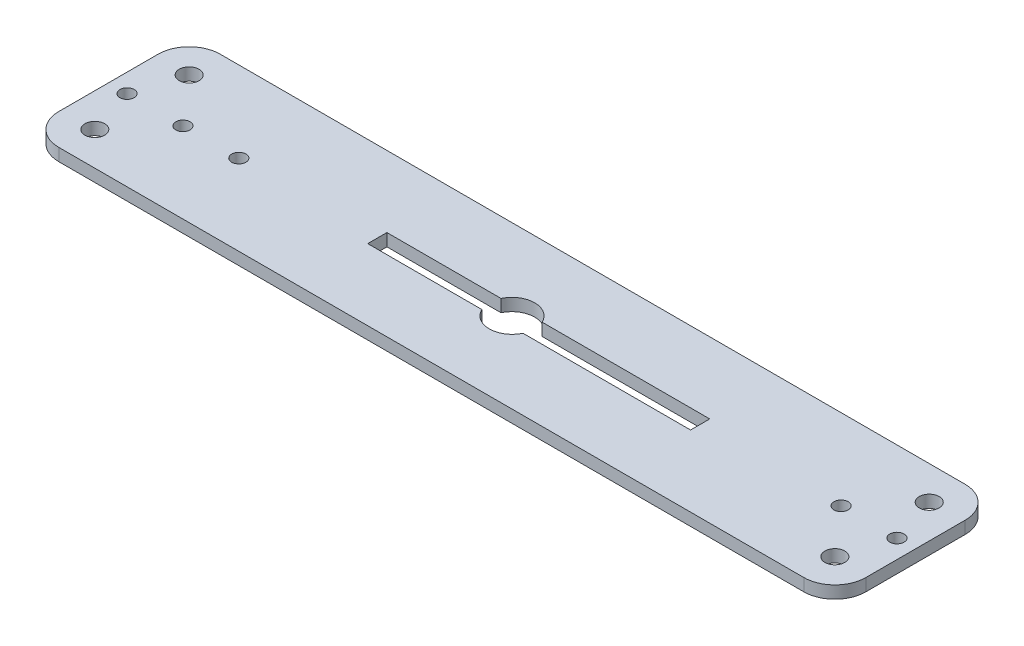
ISO-10303-21;
HEADER;
FILE_DESCRIPTION(('STEP AP214'),'2;1');
FILE_NAME('part.step','',(''),(''),'','','');
FILE_SCHEMA(('AUTOMOTIVE_DESIGN { 1 0 10303 214 1 1 1 1 }'));
ENDSEC;
DATA;
#1=APPLICATION_CONTEXT('core data for automotive mechanical design processes');
#2=APPLICATION_PROTOCOL_DEFINITION('international standard','automotive_design',2000,#1);
#3=PRODUCT_CONTEXT('',#1,'mechanical');
#4=PRODUCT('Part','Part','',(#3));
#5=PRODUCT_RELATED_PRODUCT_CATEGORY('part','',(#4));
#6=PRODUCT_DEFINITION_FORMATION('','',#4);
#7=PRODUCT_DEFINITION_CONTEXT('part definition',#1,'design');
#8=PRODUCT_DEFINITION('design','',#6,#7);
#9=PRODUCT_DEFINITION_SHAPE('','',#8);
#10=(LENGTH_UNIT() NAMED_UNIT(*) SI_UNIT(.MILLI.,.METRE.));
#11=(NAMED_UNIT(*) PLANE_ANGLE_UNIT() SI_UNIT($,.RADIAN.));
#12=(NAMED_UNIT(*) SI_UNIT($,.STERADIAN.) SOLID_ANGLE_UNIT());
#13=UNCERTAINTY_MEASURE_WITH_UNIT(LENGTH_MEASURE(1.E-05),#10,'distance_accuracy_value','');
#14=(GEOMETRIC_REPRESENTATION_CONTEXT(3) GLOBAL_UNCERTAINTY_ASSIGNED_CONTEXT((#13)) GLOBAL_UNIT_ASSIGNED_CONTEXT((#10,
#11,#12)) REPRESENTATION_CONTEXT('',''));
#15=CARTESIAN_POINT('',(0.,0.,0.));
#16=DIRECTION('',(0.,0.,1.));
#17=DIRECTION('',(1.,0.,0.));
#18=AXIS2_PLACEMENT_3D('',#15,#16,#17);
#19=CARTESIAN_POINT('',(60.,2.,-8.));
#20=DIRECTION('',(0.,1.,0.));
#21=DIRECTION('',(0.,0.,1.));
#22=AXIS2_PLACEMENT_3D('',#19,#20,#21);
#23=PLANE('',#22);
#24=CARTESIAN_POINT('',(-53.,2.,8.32369151180203E-13));
#25=DIRECTION('',(0.,1.,0.));
#26=DIRECTION('',(0.,0.,1.));
#27=AXIS2_PLACEMENT_3D('',#24,#25,#26);
#28=CIRCLE('',#27,1.15);
#29=CARTESIAN_POINT('',(-53.,2.,1.15000000000083));
#30=VERTEX_POINT('',#29);
#31=EDGE_CURVE('E408',#30,#30,#28,.T.);
#32=ORIENTED_EDGE('',*,*,#31,.F.);
#33=EDGE_LOOP('',(#32));
#34=FACE_BOUND('',#33,.T.);
#35=CARTESIAN_POINT('',(-59.6,2.,-7.59999999999916));
#36=DIRECTION('',(0.,1.,0.));
#37=DIRECTION('',(0.,0.,1.));
#38=AXIS2_PLACEMENT_3D('',#35,#36,#37);
#39=CIRCLE('',#38,1.6);
#40=CARTESIAN_POINT('',(-59.6,2.,-5.99999999999917));
#41=VERTEX_POINT('',#40);
#42=EDGE_CURVE('E420',#41,#41,#39,.T.);
#43=ORIENTED_EDGE('',*,*,#42,.F.);
#44=EDGE_LOOP('',(#43));
#45=FACE_BOUND('',#44,.T.);
#46=CARTESIAN_POINT('',(53.,2.,0.));
#47=DIRECTION('',(0.,1.,0.));
#48=DIRECTION('',(0.,0.,1.));
#49=AXIS2_PLACEMENT_3D('',#46,#47,#48);
#50=CIRCLE('',#49,1.15);
#51=CARTESIAN_POINT('',(53.,2.,1.14999999999999));
#52=VERTEX_POINT('',#51);
#53=EDGE_CURVE('E432',#52,#52,#50,.T.);
#54=ORIENTED_EDGE('',*,*,#53,.F.);
#55=EDGE_LOOP('',(#54));
#56=FACE_BOUND('',#55,.T.);
#57=CARTESIAN_POINT('',(59.6,2.,7.6));
#58=DIRECTION('',(0.,1.,0.));
#59=DIRECTION('',(0.,0.,1.));
#60=AXIS2_PLACEMENT_3D('',#57,#58,#59);
#61=CIRCLE('',#60,1.6);
#62=CARTESIAN_POINT('',(59.6,2.,9.19999999999999));
#63=VERTEX_POINT('',#62);
#64=EDGE_CURVE('E444',#63,#63,#61,.T.);
#65=ORIENTED_EDGE('',*,*,#64,.F.);
#66=EDGE_LOOP('',(#65));
#67=FACE_BOUND('',#66,.T.);
#68=DIRECTION('',(-1.,0.,0.));
#69=VECTOR('',#68,1.);
#70=CARTESIAN_POINT('',(3.30714399453822,2.,-1.54444119324422));
#71=LINE('',#70,#69);
#72=CARTESIAN_POINT('',(30.3071439945382,2.,-1.54444119324422));
#73=VERTEX_POINT('',#72);
#74=CARTESIAN_POINT('',(3.30714399453822,2.,-1.54444119324422));
#75=VERTEX_POINT('',#74);
#76=EDGE_CURVE('E153',#73,#75,#71,.T.);
#77=ORIENTED_EDGE('',*,*,#76,.F.);
#78=DIRECTION('',(0.,0.,-1.));
#79=VECTOR('',#78,1.);
#80=CARTESIAN_POINT('',(30.3071439945382,2.,-1.54444119324422));
#81=LINE('',#80,#79);
#82=CARTESIAN_POINT('',(30.3071439945382,2.,1.54444119324422));
#83=VERTEX_POINT('',#82);
#84=EDGE_CURVE('E145',#83,#73,#81,.T.);
#85=ORIENTED_EDGE('',*,*,#84,.F.);
#86=DIRECTION('',(1.,0.,0.));
#87=VECTOR('',#86,1.);
#88=CARTESIAN_POINT('',(3.30714399453821,2.,1.54444119324422));
#89=LINE('',#88,#87);
#90=CARTESIAN_POINT('',(3.30714399453821,2.,1.54444119324423));
#91=VERTEX_POINT('',#90);
#92=EDGE_CURVE('E180',#91,#83,#89,.T.);
#93=ORIENTED_EDGE('',*,*,#92,.F.);
#94=CARTESIAN_POINT('',(0.,2.,0.));
#95=DIRECTION('',(0.,1.,0.));
#96=DIRECTION('',(0.,0.,1.));
#97=AXIS2_PLACEMENT_3D('',#94,#95,#96);
#98=CIRCLE('',#97,3.65);
#99=CARTESIAN_POINT('',(-3.30714399453827,2.,1.54444119324422));
#100=VERTEX_POINT('',#99);
#101=EDGE_CURVE('E178',#100,#91,#98,.T.);
#102=ORIENTED_EDGE('',*,*,#101,.F.);
#103=DIRECTION('',(1.,0.,0.));
#104=VECTOR('',#103,1.);
#105=CARTESIAN_POINT('',(-21.6928560054618,2.,1.54444119324422));
#106=LINE('',#105,#104);
#107=CARTESIAN_POINT('',(-21.6928560054618,2.,1.54444119324422));
#108=VERTEX_POINT('',#107);
#109=EDGE_CURVE('E176',#108,#100,#106,.T.);
#110=ORIENTED_EDGE('',*,*,#109,.F.);
#111=DIRECTION('',(0.,0.,1.));
#112=VECTOR('',#111,1.);
#113=CARTESIAN_POINT('',(-21.6928560054618,2.,-1.54444119324422));
#114=LINE('',#113,#112);
#115=CARTESIAN_POINT('',(-21.6928560054618,2.,-1.54444119324422));
#116=VERTEX_POINT('',#115);
#117=EDGE_CURVE('E174',#116,#108,#114,.T.);
#118=ORIENTED_EDGE('',*,*,#117,.F.);
#119=DIRECTION('',(-1.,0.,0.));
#120=VECTOR('',#119,1.);
#121=CARTESIAN_POINT('',(-21.6928560054618,2.,-1.54444119324422));
#122=LINE('',#121,#120);
#123=CARTESIAN_POINT('',(-3.30714399453827,2.,-1.54444119324422));
#124=VERTEX_POINT('',#123);
#125=EDGE_CURVE('E169',#124,#116,#122,.T.);
#126=ORIENTED_EDGE('',*,*,#125,.F.);
#127=CARTESIAN_POINT('',(0.,2.,0.));
#128=DIRECTION('',(0.,1.,0.));
#129=DIRECTION('',(0.,0.,1.));
#130=AXIS2_PLACEMENT_3D('',#127,#128,#129);
#131=CIRCLE('',#130,3.65);
#132=EDGE_CURVE('E167',#75,#124,#131,.T.);
#133=ORIENTED_EDGE('',*,*,#132,.F.);
#134=EDGE_LOOP('',(#77,#85,#93,#102,#110,#118,#126,#133));
#135=FACE_BOUND('',#134,.T.);
#136=CARTESIAN_POINT('',(60.,2.,-8.));
#137=DIRECTION('',(0.,1.,0.));
#138=DIRECTION('',(0.,0.,1.));
#139=AXIS2_PLACEMENT_3D('',#136,#137,#138);
#140=CIRCLE('',#139,5.);
#141=CARTESIAN_POINT('',(65.,2.,-7.99999999999997));
#142=VERTEX_POINT('',#141);
#143=CARTESIAN_POINT('',(59.9999999999999,2.,-13.));
#144=VERTEX_POINT('',#143);
#145=EDGE_CURVE('E213',#142,#144,#140,.T.);
#146=ORIENTED_EDGE('',*,*,#145,.T.);
#147=DIRECTION('',(-1.,0.,0.));
#148=VECTOR('',#147,1.);
#149=CARTESIAN_POINT('',(-60.,2.,-13.));
#150=LINE('',#149,#148);
#151=CARTESIAN_POINT('',(-60.,2.,-13.));
#152=VERTEX_POINT('',#151);
#153=EDGE_CURVE('E216',#144,#152,#150,.T.);
#154=ORIENTED_EDGE('',*,*,#153,.T.);
#155=CARTESIAN_POINT('',(-60.,2.,-8.));
#156=DIRECTION('',(0.,1.,0.));
#157=DIRECTION('',(0.,0.,-1.));
#158=AXIS2_PLACEMENT_3D('',#155,#156,#157);
#159=CIRCLE('',#158,5.);
#160=CARTESIAN_POINT('',(-65.,2.,-7.99999999999997));
#161=VERTEX_POINT('',#160);
#162=EDGE_CURVE('E219',#152,#161,#159,.T.);
#163=ORIENTED_EDGE('',*,*,#162,.T.);
#164=DIRECTION('',(0.,0.,1.));
#165=VECTOR('',#164,1.);
#166=CARTESIAN_POINT('',(-65.,2.,7.99999999999996));
#167=LINE('',#166,#165);
#168=CARTESIAN_POINT('',(-65.,2.,7.99999999999996));
#169=VERTEX_POINT('',#168);
#170=EDGE_CURVE('E221',#161,#169,#167,.T.);
#171=ORIENTED_EDGE('',*,*,#170,.T.);
#172=CARTESIAN_POINT('',(-60.,2.,8.));
#173=DIRECTION('',(0.,1.,0.));
#174=DIRECTION('',(0.,0.,-1.));
#175=AXIS2_PLACEMENT_3D('',#172,#173,#174);
#176=CIRCLE('',#175,5.);
#177=CARTESIAN_POINT('',(-60.,2.,13.));
#178=VERTEX_POINT('',#177);
#179=EDGE_CURVE('E223',#169,#178,#176,.T.);
#180=ORIENTED_EDGE('',*,*,#179,.T.);
#181=DIRECTION('',(1.,0.,0.));
#182=VECTOR('',#181,1.);
#183=CARTESIAN_POINT('',(-60.,2.,13.));
#184=LINE('',#183,#182);
#185=CARTESIAN_POINT('',(59.9999999999999,2.,13.));
#186=VERTEX_POINT('',#185);
#187=EDGE_CURVE('E225',#178,#186,#184,.T.);
#188=ORIENTED_EDGE('',*,*,#187,.T.);
#189=CARTESIAN_POINT('',(60.,2.,8.));
#190=DIRECTION('',(0.,1.,0.));
#191=DIRECTION('',(0.,0.,-1.));
#192=AXIS2_PLACEMENT_3D('',#189,#190,#191);
#193=CIRCLE('',#192,5.);
#194=CARTESIAN_POINT('',(65.,2.,7.99999999999996));
#195=VERTEX_POINT('',#194);
#196=EDGE_CURVE('E227',#186,#195,#193,.T.);
#197=ORIENTED_EDGE('',*,*,#196,.T.);
#198=DIRECTION('',(0.,0.,-1.));
#199=VECTOR('',#198,1.);
#200=CARTESIAN_POINT('',(65.,2.,7.99999999999996));
#201=LINE('',#200,#199);
#202=EDGE_CURVE('E229',#195,#142,#201,.T.);
#203=ORIENTED_EDGE('',*,*,#202,.T.);
#204=EDGE_LOOP('',(#146,#154,#163,#171,#180,#188,#197,#203));
#205=FACE_BOUND('',#204,.T.);
#206=CARTESIAN_POINT('',(59.6,2.,-7.6));
#207=DIRECTION('',(0.,1.,0.));
#208=DIRECTION('',(0.,0.,1.));
#209=AXIS2_PLACEMENT_3D('',#206,#207,#208);
#210=CIRCLE('',#209,1.6);
#211=CARTESIAN_POINT('',(59.6,2.,-6.));
#212=VERTEX_POINT('',#211);
#213=EDGE_CURVE('E183',#212,#212,#210,.T.);
#214=ORIENTED_EDGE('',*,*,#213,.F.);
#215=EDGE_LOOP('',(#214));
#216=FACE_BOUND('',#215,.T.);
#217=CARTESIAN_POINT('',(62.,2.,0.));
#218=DIRECTION('',(0.,1.,0.));
#219=DIRECTION('',(0.,0.,1.));
#220=AXIS2_PLACEMENT_3D('',#217,#218,#219);
#221=CIRCLE('',#220,1.15000000000002);
#222=CARTESIAN_POINT('',(62.,2.,1.15000000000002));
#223=VERTEX_POINT('',#222);
#224=EDGE_CURVE('E438',#223,#223,#221,.T.);
#225=ORIENTED_EDGE('',*,*,#224,.F.);
#226=EDGE_LOOP('',(#225));
#227=FACE_BOUND('',#226,.T.);
#228=CARTESIAN_POINT('',(-62.,2.,8.32369151180203E-13));
#229=DIRECTION('',(0.,1.,0.));
#230=DIRECTION('',(0.,0.,1.));
#231=AXIS2_PLACEMENT_3D('',#228,#229,#230);
#232=CIRCLE('',#231,1.15);
#233=CARTESIAN_POINT('',(-62.,2.,1.15000000000083));
#234=VERTEX_POINT('',#233);
#235=EDGE_CURVE('E426',#234,#234,#232,.T.);
#236=ORIENTED_EDGE('',*,*,#235,.F.);
#237=EDGE_LOOP('',(#236));
#238=FACE_BOUND('',#237,.T.);
#239=CARTESIAN_POINT('',(-59.6,2.,7.60000000000083));
#240=DIRECTION('',(0.,1.,0.));
#241=DIRECTION('',(0.,0.,1.));
#242=AXIS2_PLACEMENT_3D('',#239,#240,#241);
#243=CIRCLE('',#242,1.6);
#244=CARTESIAN_POINT('',(-59.6,2.,9.20000000000083));
#245=VERTEX_POINT('',#244);
#246=EDGE_CURVE('E414',#245,#245,#243,.T.);
#247=ORIENTED_EDGE('',*,*,#246,.F.);
#248=EDGE_LOOP('',(#247));
#249=FACE_BOUND('',#248,.T.);
#250=CARTESIAN_POINT('',(-44.,2.,8.32369067656005E-13));
#251=DIRECTION('',(0.,1.,0.));
#252=DIRECTION('',(0.,0.,1.));
#253=AXIS2_PLACEMENT_3D('',#250,#251,#252);
#254=CIRCLE('',#253,1.15);
#255=CARTESIAN_POINT('',(-44.,2.,1.15000000000083));
#256=VERTEX_POINT('',#255);
#257=EDGE_CURVE('E399',#256,#256,#254,.T.);
#258=ORIENTED_EDGE('',*,*,#257,.F.);
#259=EDGE_LOOP('',(#258));
#260=FACE_BOUND('',#259,.T.);
#261=ADVANCED_FACE('F32',(#34,#45,#56,#67,#135,#205,#216,#227,#238,#249,#260),#23,.T.);
#262=CARTESIAN_POINT('',(60.,0.,-8.));
#263=DIRECTION('',(0.,1.,0.));
#264=DIRECTION('',(0.,0.,1.));
#265=AXIS2_PLACEMENT_3D('',#262,#263,#264);
#266=PLANE('',#265);
#267=CARTESIAN_POINT('',(-53.,0.,8.32369151180203E-13));
#268=DIRECTION('',(0.,1.,0.));
#269=DIRECTION('',(0.,0.,1.));
#270=AXIS2_PLACEMENT_3D('',#267,#268,#269);
#271=CIRCLE('',#270,1.15);
#272=CARTESIAN_POINT('',(-53.,0.,1.15000000000083));
#273=VERTEX_POINT('',#272);
#274=EDGE_CURVE('E405',#273,#273,#271,.T.);
#275=ORIENTED_EDGE('',*,*,#274,.T.);
#276=EDGE_LOOP('',(#275));
#277=FACE_BOUND('',#276,.T.);
#278=CARTESIAN_POINT('',(-59.6,0.,-7.59999999999916));
#279=DIRECTION('',(0.,1.,0.));
#280=DIRECTION('',(0.,0.,1.));
#281=AXIS2_PLACEMENT_3D('',#278,#279,#280);
#282=CIRCLE('',#281,1.6);
#283=CARTESIAN_POINT('',(-59.6,0.,-5.99999999999917));
#284=VERTEX_POINT('',#283);
#285=EDGE_CURVE('E417',#284,#284,#282,.T.);
#286=ORIENTED_EDGE('',*,*,#285,.T.);
#287=EDGE_LOOP('',(#286));
#288=FACE_BOUND('',#287,.T.);
#289=CARTESIAN_POINT('',(53.,0.,0.));
#290=DIRECTION('',(0.,1.,0.));
#291=DIRECTION('',(0.,0.,1.));
#292=AXIS2_PLACEMENT_3D('',#289,#290,#291);
#293=CIRCLE('',#292,1.15);
#294=CARTESIAN_POINT('',(53.,0.,1.14999999999999));
#295=VERTEX_POINT('',#294);
#296=EDGE_CURVE('E429',#295,#295,#293,.T.);
#297=ORIENTED_EDGE('',*,*,#296,.T.);
#298=EDGE_LOOP('',(#297));
#299=FACE_BOUND('',#298,.T.);
#300=CARTESIAN_POINT('',(59.6,0.,7.6));
#301=DIRECTION('',(0.,1.,0.));
#302=DIRECTION('',(0.,0.,1.));
#303=AXIS2_PLACEMENT_3D('',#300,#301,#302);
#304=CIRCLE('',#303,1.6);
#305=CARTESIAN_POINT('',(59.6,0.,9.19999999999999));
#306=VERTEX_POINT('',#305);
#307=EDGE_CURVE('E441',#306,#306,#304,.T.);
#308=ORIENTED_EDGE('',*,*,#307,.T.);
#309=EDGE_LOOP('',(#308));
#310=FACE_BOUND('',#309,.T.);
#311=DIRECTION('',(0.,0.,-1.));
#312=VECTOR('',#311,1.);
#313=CARTESIAN_POINT('',(30.3071439945382,0.,-1.54444119324422));
#314=LINE('',#313,#312);
#315=CARTESIAN_POINT('',(30.3071439945382,0.,1.54444119324423));
#316=VERTEX_POINT('',#315);
#317=CARTESIAN_POINT('',(30.3071439945382,0.,-1.54444119324422));
#318=VERTEX_POINT('',#317);
#319=EDGE_CURVE('E55',#316,#318,#314,.T.);
#320=ORIENTED_EDGE('',*,*,#319,.T.);
#321=DIRECTION('',(-1.,0.,0.));
#322=VECTOR('',#321,1.);
#323=CARTESIAN_POINT('',(3.30714399453822,0.,-1.54444119324422));
#324=LINE('',#323,#322);
#325=CARTESIAN_POINT('',(3.30714399453822,0.,-1.54444119324422));
#326=VERTEX_POINT('',#325);
#327=EDGE_CURVE('E160',#318,#326,#324,.T.);
#328=ORIENTED_EDGE('',*,*,#327,.T.);
#329=CARTESIAN_POINT('',(0.,0.,0.));
#330=DIRECTION('',(0.,1.,0.));
#331=DIRECTION('',(0.,0.,1.));
#332=AXIS2_PLACEMENT_3D('',#329,#330,#331);
#333=CIRCLE('',#332,3.65);
#334=CARTESIAN_POINT('',(-3.30714399453827,0.,-1.54444119324422));
#335=VERTEX_POINT('',#334);
#336=EDGE_CURVE('E185',#326,#335,#333,.T.);
#337=ORIENTED_EDGE('',*,*,#336,.T.);
#338=DIRECTION('',(-1.,0.,0.));
#339=VECTOR('',#338,1.);
#340=CARTESIAN_POINT('',(-21.6928560054618,0.,-1.54444119324422));
#341=LINE('',#340,#339);
#342=CARTESIAN_POINT('',(-21.6928560054618,0.,-1.54444119324422));
#343=VERTEX_POINT('',#342);
#344=EDGE_CURVE('E188',#335,#343,#341,.T.);
#345=ORIENTED_EDGE('',*,*,#344,.T.);
#346=DIRECTION('',(0.,0.,1.));
#347=VECTOR('',#346,1.);
#348=CARTESIAN_POINT('',(-21.6928560054618,0.,-1.54444119324422));
#349=LINE('',#348,#347);
#350=CARTESIAN_POINT('',(-21.6928560054618,0.,1.54444119324422));
#351=VERTEX_POINT('',#350);
#352=EDGE_CURVE('E191',#343,#351,#349,.T.);
#353=ORIENTED_EDGE('',*,*,#352,.T.);
#354=DIRECTION('',(1.,0.,0.));
#355=VECTOR('',#354,1.);
#356=CARTESIAN_POINT('',(-21.6928560054618,0.,1.54444119324422));
#357=LINE('',#356,#355);
#358=CARTESIAN_POINT('',(-3.30714399453827,0.,1.54444119324422));
#359=VERTEX_POINT('',#358);
#360=EDGE_CURVE('E194',#351,#359,#357,.T.);
#361=ORIENTED_EDGE('',*,*,#360,.T.);
#362=CARTESIAN_POINT('',(0.,0.,0.));
#363=DIRECTION('',(0.,1.,0.));
#364=DIRECTION('',(0.,0.,1.));
#365=AXIS2_PLACEMENT_3D('',#362,#363,#364);
#366=CIRCLE('',#365,3.65);
#367=CARTESIAN_POINT('',(3.30714399453821,0.,1.54444119324422));
#368=VERTEX_POINT('',#367);
#369=EDGE_CURVE('E197',#359,#368,#366,.T.);
#370=ORIENTED_EDGE('',*,*,#369,.T.);
#371=DIRECTION('',(1.,0.,0.));
#372=VECTOR('',#371,1.);
#373=CARTESIAN_POINT('',(3.30714399453821,0.,1.54444119324422));
#374=LINE('',#373,#372);
#375=EDGE_CURVE('E154',#368,#316,#374,.T.);
#376=ORIENTED_EDGE('',*,*,#375,.T.);
#377=EDGE_LOOP('',(#320,#328,#337,#345,#353,#361,#370,#376));
#378=FACE_BOUND('',#377,.T.);
#379=CARTESIAN_POINT('',(60.,0.,-8.));
#380=DIRECTION('',(0.,1.,0.));
#381=DIRECTION('',(0.,0.,1.));
#382=AXIS2_PLACEMENT_3D('',#379,#380,#381);
#383=CIRCLE('',#382,5.);
#384=CARTESIAN_POINT('',(65.,0.,-7.99999999999997));
#385=VERTEX_POINT('',#384);
#386=CARTESIAN_POINT('',(59.9999999999999,0.,-13.));
#387=VERTEX_POINT('',#386);
#388=EDGE_CURVE('E161',#385,#387,#383,.T.);
#389=ORIENTED_EDGE('',*,*,#388,.F.);
#390=DIRECTION('',(0.,0.,-1.));
#391=VECTOR('',#390,1.);
#392=CARTESIAN_POINT('',(65.,0.,7.99999999999996));
#393=LINE('',#392,#391);
#394=CARTESIAN_POINT('',(65.,0.,7.99999999999996));
#395=VERTEX_POINT('',#394);
#396=EDGE_CURVE('E217',#395,#385,#393,.T.);
#397=ORIENTED_EDGE('',*,*,#396,.F.);
#398=CARTESIAN_POINT('',(60.,0.,8.));
#399=DIRECTION('',(0.,1.,0.));
#400=DIRECTION('',(0.,0.,-1.));
#401=AXIS2_PLACEMENT_3D('',#398,#399,#400);
#402=CIRCLE('',#401,5.);
#403=CARTESIAN_POINT('',(59.9999999999999,0.,13.));
#404=VERTEX_POINT('',#403);
#405=EDGE_CURVE('E244',#404,#395,#402,.T.);
#406=ORIENTED_EDGE('',*,*,#405,.F.);
#407=DIRECTION('',(1.,0.,0.));
#408=VECTOR('',#407,1.);
#409=CARTESIAN_POINT('',(-60.,0.,13.));
#410=LINE('',#409,#408);
#411=CARTESIAN_POINT('',(-60.,0.,13.));
#412=VERTEX_POINT('',#411);
#413=EDGE_CURVE('E242',#412,#404,#410,.T.);
#414=ORIENTED_EDGE('',*,*,#413,.F.);
#415=CARTESIAN_POINT('',(-60.,0.,8.));
#416=DIRECTION('',(0.,1.,0.));
#417=DIRECTION('',(0.,0.,-1.));
#418=AXIS2_PLACEMENT_3D('',#415,#416,#417);
#419=CIRCLE('',#418,5.);
#420=CARTESIAN_POINT('',(-65.,0.,7.99999999999996));
#421=VERTEX_POINT('',#420);
#422=EDGE_CURVE('E240',#421,#412,#419,.T.);
#423=ORIENTED_EDGE('',*,*,#422,.F.);
#424=DIRECTION('',(0.,0.,1.));
#425=VECTOR('',#424,1.);
#426=CARTESIAN_POINT('',(-65.,0.,7.99999999999996));
#427=LINE('',#426,#425);
#428=CARTESIAN_POINT('',(-65.,0.,-7.99999999999997));
#429=VERTEX_POINT('',#428);
#430=EDGE_CURVE('E238',#429,#421,#427,.T.);
#431=ORIENTED_EDGE('',*,*,#430,.F.);
#432=CARTESIAN_POINT('',(-60.,0.,-8.));
#433=DIRECTION('',(0.,1.,0.));
#434=DIRECTION('',(0.,0.,-1.));
#435=AXIS2_PLACEMENT_3D('',#432,#433,#434);
#436=CIRCLE('',#435,5.);
#437=CARTESIAN_POINT('',(-60.,0.,-13.));
#438=VERTEX_POINT('',#437);
#439=EDGE_CURVE('E236',#438,#429,#436,.T.);
#440=ORIENTED_EDGE('',*,*,#439,.F.);
#441=DIRECTION('',(-1.,0.,0.));
#442=VECTOR('',#441,1.);
#443=CARTESIAN_POINT('',(-60.,0.,-13.));
#444=LINE('',#443,#442);
#445=EDGE_CURVE('E234',#387,#438,#444,.T.);
#446=ORIENTED_EDGE('',*,*,#445,.F.);
#447=EDGE_LOOP('',(#389,#397,#406,#414,#423,#431,#440,#446));
#448=FACE_BOUND('',#447,.T.);
#449=CARTESIAN_POINT('',(59.6,0.,-7.6));
#450=DIRECTION('',(0.,1.,0.));
#451=DIRECTION('',(0.,0.,1.));
#452=AXIS2_PLACEMENT_3D('',#449,#450,#451);
#453=CIRCLE('',#452,1.6);
#454=CARTESIAN_POINT('',(59.6,0.,-6.));
#455=VERTEX_POINT('',#454);
#456=EDGE_CURVE('E447',#455,#455,#453,.T.);
#457=ORIENTED_EDGE('',*,*,#456,.T.);
#458=EDGE_LOOP('',(#457));
#459=FACE_BOUND('',#458,.T.);
#460=CARTESIAN_POINT('',(62.,0.,0.));
#461=DIRECTION('',(0.,1.,0.));
#462=DIRECTION('',(0.,0.,1.));
#463=AXIS2_PLACEMENT_3D('',#460,#461,#462);
#464=CIRCLE('',#463,1.15000000000002);
#465=CARTESIAN_POINT('',(62.,0.,1.15000000000002));
#466=VERTEX_POINT('',#465);
#467=EDGE_CURVE('E435',#466,#466,#464,.T.);
#468=ORIENTED_EDGE('',*,*,#467,.T.);
#469=EDGE_LOOP('',(#468));
#470=FACE_BOUND('',#469,.T.);
#471=CARTESIAN_POINT('',(-62.,0.,8.32369151180203E-13));
#472=DIRECTION('',(0.,1.,0.));
#473=DIRECTION('',(0.,0.,1.));
#474=AXIS2_PLACEMENT_3D('',#471,#472,#473);
#475=CIRCLE('',#474,1.15);
#476=CARTESIAN_POINT('',(-62.,0.,1.15000000000083));
#477=VERTEX_POINT('',#476);
#478=EDGE_CURVE('E423',#477,#477,#475,.T.);
#479=ORIENTED_EDGE('',*,*,#478,.T.);
#480=EDGE_LOOP('',(#479));
#481=FACE_BOUND('',#480,.T.);
#482=CARTESIAN_POINT('',(-59.6,0.,7.60000000000083));
#483=DIRECTION('',(0.,1.,0.));
#484=DIRECTION('',(0.,0.,1.));
#485=AXIS2_PLACEMENT_3D('',#482,#483,#484);
#486=CIRCLE('',#485,1.6);
#487=CARTESIAN_POINT('',(-59.6,0.,9.20000000000083));
#488=VERTEX_POINT('',#487);
#489=EDGE_CURVE('E411',#488,#488,#486,.T.);
#490=ORIENTED_EDGE('',*,*,#489,.T.);
#491=EDGE_LOOP('',(#490));
#492=FACE_BOUND('',#491,.T.);
#493=CARTESIAN_POINT('',(-44.,0.,8.32369067656005E-13));
#494=DIRECTION('',(0.,1.,0.));
#495=DIRECTION('',(0.,0.,1.));
#496=AXIS2_PLACEMENT_3D('',#493,#494,#495);
#497=CIRCLE('',#496,1.15);
#498=CARTESIAN_POINT('',(-44.,0.,1.15000000000083));
#499=VERTEX_POINT('',#498);
#500=EDGE_CURVE('E402',#499,#499,#497,.T.);
#501=ORIENTED_EDGE('',*,*,#500,.T.);
#502=EDGE_LOOP('',(#501));
#503=FACE_BOUND('',#502,.T.);
#504=ADVANCED_FACE('F274',(#277,#288,#299,#310,#378,#448,#459,#470,#481,#492,#503),#266,.F.);
#505=CARTESIAN_POINT('',(60.,2.,-8.));
#506=DIRECTION('',(0.,-1.,0.));
#507=DIRECTION('',(0.,0.,-1.));
#508=AXIS2_PLACEMENT_3D('',#505,#506,#507);
#509=CYLINDRICAL_SURFACE('',#508,5.);
#510=ORIENTED_EDGE('',*,*,#388,.T.);
#511=DIRECTION('',(0.,-1.,0.));
#512=VECTOR('',#511,1.);
#513=CARTESIAN_POINT('',(59.9999999999999,2.,-13.));
#514=LINE('',#513,#512);
#515=EDGE_CURVE('E11',#144,#387,#514,.T.);
#516=ORIENTED_EDGE('',*,*,#515,.F.);
#517=ORIENTED_EDGE('',*,*,#145,.F.);
#518=DIRECTION('',(0.,-1.,0.));
#519=VECTOR('',#518,1.);
#520=CARTESIAN_POINT('',(65.,2.,-7.99999999999997));
#521=LINE('',#520,#519);
#522=EDGE_CURVE('E231',#142,#385,#521,.T.);
#523=ORIENTED_EDGE('',*,*,#522,.T.);
#524=EDGE_LOOP('',(#510,#516,#517,#523));
#525=FACE_BOUND('',#524,.T.);
#526=ADVANCED_FACE('F34',(#525),#509,.T.);
#527=CARTESIAN_POINT('',(-60.,2.,-13.));
#528=DIRECTION('',(0.,0.,1.));
#529=DIRECTION('',(1.,0.,0.));
#530=AXIS2_PLACEMENT_3D('',#527,#528,#529);
#531=PLANE('',#530);
#532=ORIENTED_EDGE('',*,*,#445,.T.);
#533=DIRECTION('',(0.,-1.,0.));
#534=VECTOR('',#533,1.);
#535=CARTESIAN_POINT('',(-60.,2.,-13.));
#536=LINE('',#535,#534);
#537=EDGE_CURVE('E40',#152,#438,#536,.T.);
#538=ORIENTED_EDGE('',*,*,#537,.F.);
#539=ORIENTED_EDGE('',*,*,#153,.F.);
#540=ORIENTED_EDGE('',*,*,#515,.T.);
#541=EDGE_LOOP('',(#532,#538,#539,#540));
#542=FACE_BOUND('',#541,.T.);
#543=ADVANCED_FACE('F291',(#542),#531,.F.);
#544=CARTESIAN_POINT('',(-60.,2.,-8.));
#545=DIRECTION('',(0.,-1.,0.));
#546=DIRECTION('',(0.,0.,-1.));
#547=AXIS2_PLACEMENT_3D('',#544,#545,#546);
#548=CYLINDRICAL_SURFACE('',#547,5.);
#549=ORIENTED_EDGE('',*,*,#439,.T.);
#550=DIRECTION('',(0.,-1.,0.));
#551=VECTOR('',#550,1.);
#552=CARTESIAN_POINT('',(-65.,2.,-7.99999999999997));
#553=LINE('',#552,#551);
#554=EDGE_CURVE('E261',#161,#429,#553,.T.);
#555=ORIENTED_EDGE('',*,*,#554,.F.);
#556=ORIENTED_EDGE('',*,*,#162,.F.);
#557=ORIENTED_EDGE('',*,*,#537,.T.);
#558=EDGE_LOOP('',(#549,#555,#556,#557));
#559=FACE_BOUND('',#558,.T.);
#560=ADVANCED_FACE('F268',(#559),#548,.T.);
#561=CARTESIAN_POINT('',(-65.,2.,7.99999999999996));
#562=DIRECTION('',(1.,0.,0.));
#563=DIRECTION('',(0.,0.,-1.));
#564=AXIS2_PLACEMENT_3D('',#561,#562,#563);
#565=PLANE('',#564);
#566=ORIENTED_EDGE('',*,*,#430,.T.);
#567=DIRECTION('',(0.,-1.,0.));
#568=VECTOR('',#567,1.);
#569=CARTESIAN_POINT('',(-65.,2.,7.99999999999996));
#570=LINE('',#569,#568);
#571=EDGE_CURVE('E258',#169,#421,#570,.T.);
#572=ORIENTED_EDGE('',*,*,#571,.F.);
#573=ORIENTED_EDGE('',*,*,#170,.F.);
#574=ORIENTED_EDGE('',*,*,#554,.T.);
#575=EDGE_LOOP('',(#566,#572,#573,#574));
#576=FACE_BOUND('',#575,.T.);
#577=ADVANCED_FACE('F280',(#576),#565,.F.);
#578=CARTESIAN_POINT('',(-60.,2.,8.));
#579=DIRECTION('',(0.,-1.,0.));
#580=DIRECTION('',(0.,0.,-1.));
#581=AXIS2_PLACEMENT_3D('',#578,#579,#580);
#582=CYLINDRICAL_SURFACE('',#581,5.);
#583=ORIENTED_EDGE('',*,*,#422,.T.);
#584=DIRECTION('',(0.,-1.,0.));
#585=VECTOR('',#584,1.);
#586=CARTESIAN_POINT('',(-60.,2.,13.));
#587=LINE('',#586,#585);
#588=EDGE_CURVE('E255',#178,#412,#587,.T.);
#589=ORIENTED_EDGE('',*,*,#588,.F.);
#590=ORIENTED_EDGE('',*,*,#179,.F.);
#591=ORIENTED_EDGE('',*,*,#571,.T.);
#592=EDGE_LOOP('',(#583,#589,#590,#591));
#593=FACE_BOUND('',#592,.T.);
#594=ADVANCED_FACE('F284',(#593),#582,.T.);
#595=CARTESIAN_POINT('',(-60.,2.,13.));
#596=DIRECTION('',(0.,0.,-1.));
#597=DIRECTION('',(-1.,0.,0.));
#598=AXIS2_PLACEMENT_3D('',#595,#596,#597);
#599=PLANE('',#598);
#600=ORIENTED_EDGE('',*,*,#413,.T.);
#601=DIRECTION('',(0.,-1.,0.));
#602=VECTOR('',#601,1.);
#603=CARTESIAN_POINT('',(59.9999999999999,2.,13.));
#604=LINE('',#603,#602);
#605=EDGE_CURVE('E252',#186,#404,#604,.T.);
#606=ORIENTED_EDGE('',*,*,#605,.F.);
#607=ORIENTED_EDGE('',*,*,#187,.F.);
#608=ORIENTED_EDGE('',*,*,#588,.T.);
#609=EDGE_LOOP('',(#600,#606,#607,#608));
#610=FACE_BOUND('',#609,.T.);
#611=ADVANCED_FACE('F304',(#610),#599,.F.);
#612=CARTESIAN_POINT('',(60.,2.,8.));
#613=DIRECTION('',(0.,-1.,0.));
#614=DIRECTION('',(0.,0.,-1.));
#615=AXIS2_PLACEMENT_3D('',#612,#613,#614);
#616=CYLINDRICAL_SURFACE('',#615,5.);
#617=ORIENTED_EDGE('',*,*,#405,.T.);
#618=DIRECTION('',(0.,-1.,0.));
#619=VECTOR('',#618,1.);
#620=CARTESIAN_POINT('',(65.,2.,7.99999999999996));
#621=LINE('',#620,#619);
#622=EDGE_CURVE('E249',#195,#395,#621,.T.);
#623=ORIENTED_EDGE('',*,*,#622,.F.);
#624=ORIENTED_EDGE('',*,*,#196,.F.);
#625=ORIENTED_EDGE('',*,*,#605,.T.);
#626=EDGE_LOOP('',(#617,#623,#624,#625));
#627=FACE_BOUND('',#626,.T.);
#628=ADVANCED_FACE('F302',(#627),#616,.T.);
#629=CARTESIAN_POINT('',(65.,2.,7.99999999999996));
#630=DIRECTION('',(-1.,0.,0.));
#631=DIRECTION('',(0.,0.,1.));
#632=AXIS2_PLACEMENT_3D('',#629,#630,#631);
#633=PLANE('',#632);
#634=ORIENTED_EDGE('',*,*,#396,.T.);
#635=ORIENTED_EDGE('',*,*,#522,.F.);
#636=ORIENTED_EDGE('',*,*,#202,.F.);
#637=ORIENTED_EDGE('',*,*,#622,.T.);
#638=EDGE_LOOP('',(#634,#635,#636,#637));
#639=FACE_BOUND('',#638,.T.);
#640=ADVANCED_FACE('F297',(#639),#633,.F.);
#641=CARTESIAN_POINT('',(30.3071439945382,2.,-1.54444119324422));
#642=DIRECTION('',(-1.,0.,0.));
#643=DIRECTION('',(0.,0.,1.));
#644=AXIS2_PLACEMENT_3D('',#641,#642,#643);
#645=PLANE('',#644);
#646=ORIENTED_EDGE('',*,*,#319,.F.);
#647=DIRECTION('',(0.,-1.,0.));
#648=VECTOR('',#647,1.);
#649=CARTESIAN_POINT('',(30.3071439945382,2.,1.54444119324422));
#650=LINE('',#649,#648);
#651=EDGE_CURVE('E149',#83,#316,#650,.T.);
#652=ORIENTED_EDGE('',*,*,#651,.F.);
#653=ORIENTED_EDGE('',*,*,#84,.T.);
#654=DIRECTION('',(0.,-1.,0.));
#655=VECTOR('',#654,1.);
#656=CARTESIAN_POINT('',(30.3071439945382,2.,-1.54444119324422));
#657=LINE('',#656,#655);
#658=EDGE_CURVE('E148',#73,#318,#657,.T.);
#659=ORIENTED_EDGE('',*,*,#658,.T.);
#660=EDGE_LOOP('',(#646,#652,#653,#659));
#661=FACE_BOUND('',#660,.T.);
#662=ADVANCED_FACE('F147',(#661),#645,.T.);
#663=CARTESIAN_POINT('',(3.30714399453822,2.,-1.54444119324422));
#664=DIRECTION('',(0.,0.,1.));
#665=DIRECTION('',(1.,0.,0.));
#666=AXIS2_PLACEMENT_3D('',#663,#664,#665);
#667=PLANE('',#666);
#668=ORIENTED_EDGE('',*,*,#327,.F.);
#669=ORIENTED_EDGE('',*,*,#658,.F.);
#670=ORIENTED_EDGE('',*,*,#76,.T.);
#671=DIRECTION('',(0.,-1.,0.));
#672=VECTOR('',#671,1.);
#673=CARTESIAN_POINT('',(3.30714399453822,2.,-1.54444119324422));
#674=LINE('',#673,#672);
#675=EDGE_CURVE('E162',#75,#326,#674,.T.);
#676=ORIENTED_EDGE('',*,*,#675,.T.);
#677=EDGE_LOOP('',(#668,#669,#670,#676));
#678=FACE_BOUND('',#677,.T.);
#679=ADVANCED_FACE('F157',(#678),#667,.T.);
#680=CARTESIAN_POINT('',(0.,2.,0.));
#681=DIRECTION('',(0.,-1.,0.));
#682=DIRECTION('',(0.,0.,-1.));
#683=AXIS2_PLACEMENT_3D('',#680,#681,#682);
#684=CYLINDRICAL_SURFACE('',#683,3.65);
#685=ORIENTED_EDGE('',*,*,#336,.F.);
#686=ORIENTED_EDGE('',*,*,#675,.F.);
#687=ORIENTED_EDGE('',*,*,#132,.T.);
#688=DIRECTION('',(0.,-1.,0.));
#689=VECTOR('',#688,1.);
#690=CARTESIAN_POINT('',(-3.30714399453827,2.,-1.54444119324422));
#691=LINE('',#690,#689);
#692=EDGE_CURVE('E210',#124,#335,#691,.T.);
#693=ORIENTED_EDGE('',*,*,#692,.T.);
#694=EDGE_LOOP('',(#685,#686,#687,#693));
#695=FACE_BOUND('',#694,.T.);
#696=ADVANCED_FACE('F333',(#695),#684,.F.);
#697=CARTESIAN_POINT('',(-21.6928560054618,2.,-1.54444119324422));
#698=DIRECTION('',(0.,0.,1.));
#699=DIRECTION('',(1.,0.,0.));
#700=AXIS2_PLACEMENT_3D('',#697,#698,#699);
#701=PLANE('',#700);
#702=ORIENTED_EDGE('',*,*,#344,.F.);
#703=ORIENTED_EDGE('',*,*,#692,.F.);
#704=ORIENTED_EDGE('',*,*,#125,.T.);
#705=DIRECTION('',(0.,-1.,0.));
#706=VECTOR('',#705,1.);
#707=CARTESIAN_POINT('',(-21.6928560054618,2.,-1.54444119324422));
#708=LINE('',#707,#706);
#709=EDGE_CURVE('E208',#116,#343,#708,.T.);
#710=ORIENTED_EDGE('',*,*,#709,.T.);
#711=EDGE_LOOP('',(#702,#703,#704,#710));
#712=FACE_BOUND('',#711,.T.);
#713=ADVANCED_FACE('F337',(#712),#701,.T.);
#714=CARTESIAN_POINT('',(-21.6928560054618,2.,-1.54444119324422));
#715=DIRECTION('',(1.,0.,0.));
#716=DIRECTION('',(0.,0.,-1.));
#717=AXIS2_PLACEMENT_3D('',#714,#715,#716);
#718=PLANE('',#717);
#719=ORIENTED_EDGE('',*,*,#352,.F.);
#720=ORIENTED_EDGE('',*,*,#709,.F.);
#721=ORIENTED_EDGE('',*,*,#117,.T.);
#722=DIRECTION('',(0.,-1.,0.));
#723=VECTOR('',#722,1.);
#724=CARTESIAN_POINT('',(-21.6928560054618,2.,1.54444119324422));
#725=LINE('',#724,#723);
#726=EDGE_CURVE('E206',#108,#351,#725,.T.);
#727=ORIENTED_EDGE('',*,*,#726,.T.);
#728=EDGE_LOOP('',(#719,#720,#721,#727));
#729=FACE_BOUND('',#728,.T.);
#730=ADVANCED_FACE('F343',(#729),#718,.T.);
#731=CARTESIAN_POINT('',(-21.6928560054618,2.,1.54444119324422));
#732=DIRECTION('',(0.,0.,-1.));
#733=DIRECTION('',(-1.,0.,0.));
#734=AXIS2_PLACEMENT_3D('',#731,#732,#733);
#735=PLANE('',#734);
#736=ORIENTED_EDGE('',*,*,#360,.F.);
#737=ORIENTED_EDGE('',*,*,#726,.F.);
#738=ORIENTED_EDGE('',*,*,#109,.T.);
#739=DIRECTION('',(0.,-1.,0.));
#740=VECTOR('',#739,1.);
#741=CARTESIAN_POINT('',(-3.30714399453827,2.,1.54444119324422));
#742=LINE('',#741,#740);
#743=EDGE_CURVE('E204',#100,#359,#742,.T.);
#744=ORIENTED_EDGE('',*,*,#743,.T.);
#745=EDGE_LOOP('',(#736,#737,#738,#744));
#746=FACE_BOUND('',#745,.T.);
#747=ADVANCED_FACE('F347',(#746),#735,.T.);
#748=CARTESIAN_POINT('',(0.,2.,0.));
#749=DIRECTION('',(0.,-1.,0.));
#750=DIRECTION('',(0.,0.,-1.));
#751=AXIS2_PLACEMENT_3D('',#748,#749,#750);
#752=CYLINDRICAL_SURFACE('',#751,3.65);
#753=ORIENTED_EDGE('',*,*,#369,.F.);
#754=ORIENTED_EDGE('',*,*,#743,.F.);
#755=ORIENTED_EDGE('',*,*,#101,.T.);
#756=DIRECTION('',(0.,-1.,0.));
#757=VECTOR('',#756,1.);
#758=CARTESIAN_POINT('',(3.30714399453821,2.,1.54444119324422));
#759=LINE('',#758,#757);
#760=EDGE_CURVE('E47',#91,#368,#759,.T.);
#761=ORIENTED_EDGE('',*,*,#760,.T.);
#762=EDGE_LOOP('',(#753,#754,#755,#761));
#763=FACE_BOUND('',#762,.T.);
#764=ADVANCED_FACE('F351',(#763),#752,.F.);
#765=CARTESIAN_POINT('',(3.30714399453821,2.,1.54444119324422));
#766=DIRECTION('',(0.,0.,-1.));
#767=DIRECTION('',(-1.,0.,0.));
#768=AXIS2_PLACEMENT_3D('',#765,#766,#767);
#769=PLANE('',#768);
#770=ORIENTED_EDGE('',*,*,#375,.F.);
#771=ORIENTED_EDGE('',*,*,#760,.F.);
#772=ORIENTED_EDGE('',*,*,#92,.T.);
#773=ORIENTED_EDGE('',*,*,#651,.T.);
#774=EDGE_LOOP('',(#770,#771,#772,#773));
#775=FACE_BOUND('',#774,.T.);
#776=ADVANCED_FACE('F355',(#775),#769,.T.);
#777=CARTESIAN_POINT('',(59.6,2.,-7.6));
#778=DIRECTION('',(0.,-1.,0.));
#779=DIRECTION('',(0.,0.,-1.));
#780=AXIS2_PLACEMENT_3D('',#777,#778,#779);
#781=CYLINDRICAL_SURFACE('',#780,1.6);
#782=ORIENTED_EDGE('',*,*,#213,.T.);
#783=EDGE_LOOP('',(#782));
#784=FACE_BOUND('',#783,.T.);
#785=ORIENTED_EDGE('',*,*,#456,.F.);
#786=EDGE_LOOP('',(#785));
#787=FACE_BOUND('',#786,.T.);
#788=ADVANCED_FACE('F359',(#784,#787),#781,.F.);
#789=CARTESIAN_POINT('',(59.6,2.,7.6));
#790=DIRECTION('',(0.,-1.,0.));
#791=DIRECTION('',(0.,0.,-1.));
#792=AXIS2_PLACEMENT_3D('',#789,#790,#791);
#793=CYLINDRICAL_SURFACE('',#792,1.6);
#794=ORIENTED_EDGE('',*,*,#64,.T.);
#795=EDGE_LOOP('',(#794));
#796=FACE_BOUND('',#795,.T.);
#797=ORIENTED_EDGE('',*,*,#307,.F.);
#798=EDGE_LOOP('',(#797));
#799=FACE_BOUND('',#798,.T.);
#800=ADVANCED_FACE('F362',(#796,#799),#793,.F.);
#801=CARTESIAN_POINT('',(62.,2.,0.));
#802=DIRECTION('',(0.,-1.,0.));
#803=DIRECTION('',(0.,0.,-1.));
#804=AXIS2_PLACEMENT_3D('',#801,#802,#803);
#805=CYLINDRICAL_SURFACE('',#804,1.15000000000002);
#806=ORIENTED_EDGE('',*,*,#224,.T.);
#807=EDGE_LOOP('',(#806));
#808=FACE_BOUND('',#807,.T.);
#809=ORIENTED_EDGE('',*,*,#467,.F.);
#810=EDGE_LOOP('',(#809));
#811=FACE_BOUND('',#810,.T.);
#812=ADVANCED_FACE('F366',(#808,#811),#805,.F.);
#813=CARTESIAN_POINT('',(53.,2.,0.));
#814=DIRECTION('',(0.,-1.,0.));
#815=DIRECTION('',(0.,0.,-1.));
#816=AXIS2_PLACEMENT_3D('',#813,#814,#815);
#817=CYLINDRICAL_SURFACE('',#816,1.15);
#818=ORIENTED_EDGE('',*,*,#53,.T.);
#819=EDGE_LOOP('',(#818));
#820=FACE_BOUND('',#819,.T.);
#821=ORIENTED_EDGE('',*,*,#296,.F.);
#822=EDGE_LOOP('',(#821));
#823=FACE_BOUND('',#822,.T.);
#824=ADVANCED_FACE('F370',(#820,#823),#817,.F.);
#825=CARTESIAN_POINT('',(-62.,2.,8.32369151180203E-13));
#826=DIRECTION('',(0.,-1.,0.));
#827=DIRECTION('',(0.,0.,-1.));
#828=AXIS2_PLACEMENT_3D('',#825,#826,#827);
#829=CYLINDRICAL_SURFACE('',#828,1.15);
#830=ORIENTED_EDGE('',*,*,#235,.T.);
#831=EDGE_LOOP('',(#830));
#832=FACE_BOUND('',#831,.T.);
#833=ORIENTED_EDGE('',*,*,#478,.F.);
#834=EDGE_LOOP('',(#833));
#835=FACE_BOUND('',#834,.T.);
#836=ADVANCED_FACE('F374',(#832,#835),#829,.F.);
#837=CARTESIAN_POINT('',(-59.6,2.,-7.59999999999916));
#838=DIRECTION('',(0.,-1.,0.));
#839=DIRECTION('',(0.,0.,-1.));
#840=AXIS2_PLACEMENT_3D('',#837,#838,#839);
#841=CYLINDRICAL_SURFACE('',#840,1.6);
#842=ORIENTED_EDGE('',*,*,#42,.T.);
#843=EDGE_LOOP('',(#842));
#844=FACE_BOUND('',#843,.T.);
#845=ORIENTED_EDGE('',*,*,#285,.F.);
#846=EDGE_LOOP('',(#845));
#847=FACE_BOUND('',#846,.T.);
#848=ADVANCED_FACE('F378',(#844,#847),#841,.F.);
#849=CARTESIAN_POINT('',(-59.6,2.,7.60000000000083));
#850=DIRECTION('',(0.,-1.,0.));
#851=DIRECTION('',(0.,0.,-1.));
#852=AXIS2_PLACEMENT_3D('',#849,#850,#851);
#853=CYLINDRICAL_SURFACE('',#852,1.6);
#854=ORIENTED_EDGE('',*,*,#246,.T.);
#855=EDGE_LOOP('',(#854));
#856=FACE_BOUND('',#855,.T.);
#857=ORIENTED_EDGE('',*,*,#489,.F.);
#858=EDGE_LOOP('',(#857));
#859=FACE_BOUND('',#858,.T.);
#860=ADVANCED_FACE('F382',(#856,#859),#853,.F.);
#861=CARTESIAN_POINT('',(-53.,2.,8.32369151180203E-13));
#862=DIRECTION('',(0.,-1.,0.));
#863=DIRECTION('',(0.,0.,-1.));
#864=AXIS2_PLACEMENT_3D('',#861,#862,#863);
#865=CYLINDRICAL_SURFACE('',#864,1.15);
#866=ORIENTED_EDGE('',*,*,#31,.T.);
#867=EDGE_LOOP('',(#866));
#868=FACE_BOUND('',#867,.T.);
#869=ORIENTED_EDGE('',*,*,#274,.F.);
#870=EDGE_LOOP('',(#869));
#871=FACE_BOUND('',#870,.T.);
#872=ADVANCED_FACE('F386',(#868,#871),#865,.F.);
#873=CARTESIAN_POINT('',(-44.,2.,8.32369067656005E-13));
#874=DIRECTION('',(0.,-1.,0.));
#875=DIRECTION('',(0.,0.,-1.));
#876=AXIS2_PLACEMENT_3D('',#873,#874,#875);
#877=CYLINDRICAL_SURFACE('',#876,1.15);
#878=ORIENTED_EDGE('',*,*,#257,.T.);
#879=EDGE_LOOP('',(#878));
#880=FACE_BOUND('',#879,.T.);
#881=ORIENTED_EDGE('',*,*,#500,.F.);
#882=EDGE_LOOP('',(#881));
#883=FACE_BOUND('',#882,.T.);
#884=ADVANCED_FACE('F390',(#880,#883),#877,.F.);
#885=CLOSED_SHELL('',(#261,#504,#526,#543,#560,#577,#594,#611,#628,#640,#662,#679,#696,#713,
#730,#747,#764,#776,#788,#800,#812,#824,#836,#848,#860,#872,#884));
#886=MANIFOLD_SOLID_BREP('B2',#885);
#887=ADVANCED_BREP_SHAPE_REPRESENTATION('',(#18,#886),#14);
#888=SHAPE_DEFINITION_REPRESENTATION(#9,#887);
ENDSEC;
END-ISO-10303-21;
